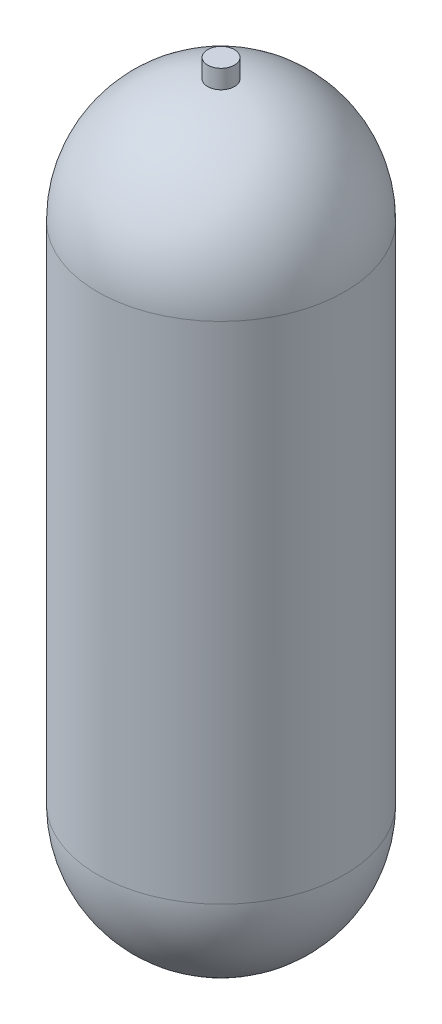
ISO-10303-21;
HEADER;
FILE_DESCRIPTION(('STEP AP214'),'2;1');
FILE_NAME('part.step','',(''),(''),'','','');
FILE_SCHEMA(('AUTOMOTIVE_DESIGN { 1 0 10303 214 1 1 1 1 }'));
ENDSEC;
DATA;
#1=APPLICATION_CONTEXT('core data for automotive mechanical design processes');
#2=APPLICATION_PROTOCOL_DEFINITION('international standard','automotive_design',2000,#1);
#3=PRODUCT_CONTEXT('',#1,'mechanical');
#4=PRODUCT('Part','Part','',(#3));
#5=PRODUCT_RELATED_PRODUCT_CATEGORY('part','',(#4));
#6=PRODUCT_DEFINITION_FORMATION('','',#4);
#7=PRODUCT_DEFINITION_CONTEXT('part definition',#1,'design');
#8=PRODUCT_DEFINITION('design','',#6,#7);
#9=PRODUCT_DEFINITION_SHAPE('','',#8);
#10=(LENGTH_UNIT() NAMED_UNIT(*) SI_UNIT(.MILLI.,.METRE.));
#11=(NAMED_UNIT(*) PLANE_ANGLE_UNIT() SI_UNIT($,.RADIAN.));
#12=(NAMED_UNIT(*) SI_UNIT($,.STERADIAN.) SOLID_ANGLE_UNIT());
#13=UNCERTAINTY_MEASURE_WITH_UNIT(LENGTH_MEASURE(1.E-05),#10,'distance_accuracy_value','');
#14=(GEOMETRIC_REPRESENTATION_CONTEXT(3) GLOBAL_UNCERTAINTY_ASSIGNED_CONTEXT((#13)) GLOBAL_UNIT_ASSIGNED_CONTEXT((#10,
#11,#12)) REPRESENTATION_CONTEXT('',''));
#15=CARTESIAN_POINT('',(0.,0.,0.));
#16=DIRECTION('',(0.,0.,1.));
#17=DIRECTION('',(1.,0.,0.));
#18=AXIS2_PLACEMENT_3D('',#15,#16,#17);
#19=CARTESIAN_POINT('',(0.,445.77,0.));
#20=DIRECTION('',(0.,-1.,0.));
#21=DIRECTION('',(1.,0.,0.));
#22=AXIS2_PLACEMENT_3D('',#19,#20,#21);
#23=SPHERICAL_SURFACE('',#22,87.63);
#24=CARTESIAN_POINT('',(0.,532.880798842491,0.));
#25=DIRECTION('',(0.,-1.,0.));
#26=DIRECTION('',(0.,0.,-1.));
#27=AXIS2_PLACEMENT_3D('',#24,#25,#26);
#28=CIRCLE('',#27,9.525);
#29=CARTESIAN_POINT('',(0.,532.880798842491,-9.525));
#30=VERTEX_POINT('',#29);
#31=EDGE_CURVE('E10',#30,#30,#28,.F.);
#32=ORIENTED_EDGE('',*,*,#31,.F.);
#33=EDGE_LOOP('',(#32));
#34=FACE_BOUND('',#33,.T.);
#35=CARTESIAN_POINT('',(0.,445.77,0.));
#36=DIRECTION('',(0.,-1.,0.));
#37=DIRECTION('',(0.,0.,-1.));
#38=AXIS2_PLACEMENT_3D('',#35,#36,#37);
#39=CIRCLE('',#38,87.63);
#40=CARTESIAN_POINT('',(0.,445.77,-87.63));
#41=VERTEX_POINT('',#40);
#42=EDGE_CURVE('E53',#41,#41,#39,.T.);
#43=ORIENTED_EDGE('',*,*,#42,.F.);
#44=EDGE_LOOP('',(#43));
#45=FACE_BOUND('',#44,.T.);
#46=ADVANCED_FACE('F33',(#34,#45),#23,.T.);
#47=CARTESIAN_POINT('',(0.,87.63,0.));
#48=DIRECTION('',(0.,-1.,0.));
#49=DIRECTION('',(-1.,0.,0.));
#50=AXIS2_PLACEMENT_3D('',#47,#48,#49);
#51=SPHERICAL_SURFACE('',#50,87.63);
#52=CARTESIAN_POINT('',(0.,87.63,0.));
#53=DIRECTION('',(0.,-1.,0.));
#54=DIRECTION('',(0.,0.,-1.));
#55=AXIS2_PLACEMENT_3D('',#52,#53,#54);
#56=CIRCLE('',#55,87.63);
#57=CARTESIAN_POINT('',(0.,87.63,-87.63));
#58=VERTEX_POINT('',#57);
#59=EDGE_CURVE('E48',#58,#58,#56,.T.);
#60=ORIENTED_EDGE('',*,*,#59,.T.);
#61=EDGE_LOOP('',(#60));
#62=FACE_BOUND('',#61,.T.);
#63=ADVANCED_FACE('F71',(#62),#51,.T.);
#64=CARTESIAN_POINT('',(0.,533.4,0.));
#65=DIRECTION('',(0.,-1.,0.));
#66=DIRECTION('',(0.,0.,-1.));
#67=AXIS2_PLACEMENT_3D('',#64,#65,#66);
#68=CYLINDRICAL_SURFACE('',#67,87.63);
#69=ORIENTED_EDGE('',*,*,#42,.T.);
#70=EDGE_LOOP('',(#69));
#71=FACE_BOUND('',#70,.T.);
#72=ORIENTED_EDGE('',*,*,#59,.F.);
#73=EDGE_LOOP('',(#72));
#74=FACE_BOUND('',#73,.T.);
#75=ADVANCED_FACE('F64',(#71,#74),#68,.T.);
#76=CARTESIAN_POINT('',(0.,-500000.,0.));
#77=DIRECTION('',(0.,1.,0.));
#78=DIRECTION('',(0.,0.,1.));
#79=AXIS2_PLACEMENT_3D('',#76,#77,#78);
#80=CYLINDRICAL_SURFACE('',#79,9.525);
#81=ORIENTED_EDGE('',*,*,#31,.T.);
#82=EDGE_LOOP('',(#81));
#83=FACE_BOUND('',#82,.T.);
#84=CARTESIAN_POINT('',(0.,546.1,0.));
#85=DIRECTION('',(0.,1.,0.));
#86=DIRECTION('',(0.,0.,1.));
#87=AXIS2_PLACEMENT_3D('',#84,#85,#86);
#88=CIRCLE('',#87,9.525);
#89=CARTESIAN_POINT('',(0.,546.1,9.525));
#90=VERTEX_POINT('',#89);
#91=EDGE_CURVE('E56',#90,#90,#88,.T.);
#92=ORIENTED_EDGE('',*,*,#91,.F.);
#93=EDGE_LOOP('',(#92));
#94=FACE_BOUND('',#93,.T.);
#95=ADVANCED_FACE('F62',(#83,#94),#80,.T.);
#96=CARTESIAN_POINT('',(0.,546.1,0.));
#97=DIRECTION('',(0.,1.,0.));
#98=DIRECTION('',(0.,0.,1.));
#99=AXIS2_PLACEMENT_3D('',#96,#97,#98);
#100=PLANE('',#99);
#101=ORIENTED_EDGE('',*,*,#91,.T.);
#102=EDGE_LOOP('',(#101));
#103=FACE_BOUND('',#102,.T.);
#104=ADVANCED_FACE('F60',(#103),#100,.T.);
#105=CLOSED_SHELL('',(#46,#63,#75,#95,#104));
#106=CARTESIAN_POINT('',(0.,445.77,0.));
#107=DIRECTION('',(0.,-1.,0.));
#108=DIRECTION('',(1.,0.,0.));
#109=AXIS2_PLACEMENT_3D('',#106,#107,#108);
#110=SPHERICAL_SURFACE('',#109,84.455);
#111=CARTESIAN_POINT('',(0.,445.77,0.));
#112=DIRECTION('',(0.,-1.,0.));
#113=DIRECTION('',(0.,0.,-1.));
#114=AXIS2_PLACEMENT_3D('',#111,#112,#113);
#115=CIRCLE('',#114,84.455);
#116=CARTESIAN_POINT('',(0.,445.77,-84.455));
#117=VERTEX_POINT('',#116);
#118=EDGE_CURVE('E40',#117,#117,#115,.T.);
#119=ORIENTED_EDGE('',*,*,#118,.T.);
#120=EDGE_LOOP('',(#119));
#121=FACE_BOUND('',#120,.T.);
#122=ADVANCED_FACE('F95',(#121),#110,.F.);
#123=CARTESIAN_POINT('',(0.,533.4,0.));
#124=DIRECTION('',(0.,-1.,0.));
#125=DIRECTION('',(0.,0.,-1.));
#126=AXIS2_PLACEMENT_3D('',#123,#124,#125);
#127=CYLINDRICAL_SURFACE('',#126,84.455);
#128=CARTESIAN_POINT('',(0.,87.63,0.));
#129=DIRECTION('',(0.,-1.,0.));
#130=DIRECTION('',(0.,0.,-1.));
#131=AXIS2_PLACEMENT_3D('',#128,#129,#130);
#132=CIRCLE('',#131,84.455);
#133=CARTESIAN_POINT('',(0.,87.63,-84.455));
#134=VERTEX_POINT('',#133);
#135=EDGE_CURVE('E44',#134,#134,#132,.T.);
#136=ORIENTED_EDGE('',*,*,#135,.T.);
#137=EDGE_LOOP('',(#136));
#138=FACE_BOUND('',#137,.T.);
#139=ORIENTED_EDGE('',*,*,#118,.F.);
#140=EDGE_LOOP('',(#139));
#141=FACE_BOUND('',#140,.T.);
#142=ADVANCED_FACE('F91',(#138,#141),#127,.F.);
#143=CARTESIAN_POINT('',(0.,87.63,0.));
#144=DIRECTION('',(0.,-1.,0.));
#145=DIRECTION('',(1.,0.,0.));
#146=AXIS2_PLACEMENT_3D('',#143,#144,#145);
#147=SPHERICAL_SURFACE('',#146,84.455);
#148=ORIENTED_EDGE('',*,*,#135,.F.);
#149=EDGE_LOOP('',(#148));
#150=FACE_BOUND('',#149,.T.);
#151=ADVANCED_FACE('F88',(#150),#147,.F.);
#152=CLOSED_SHELL('',(#122,#142,#151));
#153=ORIENTED_CLOSED_SHELL('',*,#152,.T.);
#154=BREP_WITH_VOIDS('B2',#105,(#153));
#155=ADVANCED_BREP_SHAPE_REPRESENTATION('',(#18,#154),#14);
#156=SHAPE_DEFINITION_REPRESENTATION(#9,#155);
ENDSEC;
END-ISO-10303-21;
